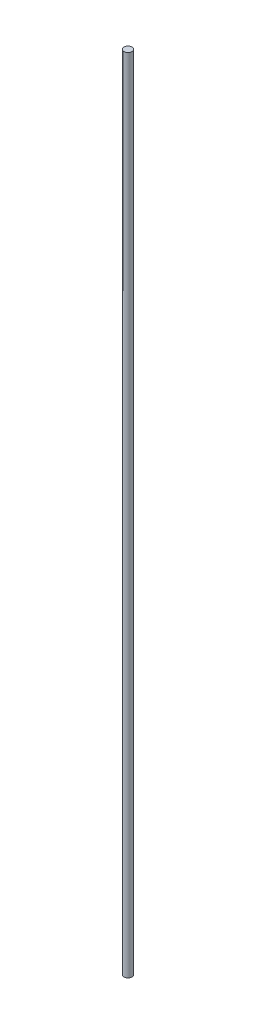
ISO-10303-21;
HEADER;
FILE_DESCRIPTION(('STEP AP214'),'2;1');
FILE_NAME('part.step','',(''),(''),'','','');
FILE_SCHEMA(('AUTOMOTIVE_DESIGN { 1 0 10303 214 1 1 1 1 }'));
ENDSEC;
DATA;
#1=APPLICATION_CONTEXT('core data for automotive mechanical design processes');
#2=APPLICATION_PROTOCOL_DEFINITION('international standard','automotive_design',2000,#1);
#3=PRODUCT_CONTEXT('',#1,'mechanical');
#4=PRODUCT('Part','Part','',(#3));
#5=PRODUCT_RELATED_PRODUCT_CATEGORY('part','',(#4));
#6=PRODUCT_DEFINITION_FORMATION('','',#4);
#7=PRODUCT_DEFINITION_CONTEXT('part definition',#1,'design');
#8=PRODUCT_DEFINITION('design','',#6,#7);
#9=PRODUCT_DEFINITION_SHAPE('','',#8);
#10=(LENGTH_UNIT() NAMED_UNIT(*) SI_UNIT(.MILLI.,.METRE.));
#11=(NAMED_UNIT(*) PLANE_ANGLE_UNIT() SI_UNIT($,.RADIAN.));
#12=(NAMED_UNIT(*) SI_UNIT($,.STERADIAN.) SOLID_ANGLE_UNIT());
#13=UNCERTAINTY_MEASURE_WITH_UNIT(LENGTH_MEASURE(1.E-05),#10,'distance_accuracy_value','');
#14=(GEOMETRIC_REPRESENTATION_CONTEXT(3) GLOBAL_UNCERTAINTY_ASSIGNED_CONTEXT((#13)) GLOBAL_UNIT_ASSIGNED_CONTEXT((#10,
#11,#12)) REPRESENTATION_CONTEXT('',''));
#15=CARTESIAN_POINT('',(0.,0.,0.));
#16=DIRECTION('',(0.,0.,1.));
#17=DIRECTION('',(1.,0.,0.));
#18=AXIS2_PLACEMENT_3D('',#15,#16,#17);
#19=CARTESIAN_POINT('',(0.,4000.,0.));
#20=DIRECTION('',(0.,-1.,0.));
#21=DIRECTION('',(0.,0.,-1.));
#22=AXIS2_PLACEMENT_3D('',#19,#20,#21);
#23=CYLINDRICAL_SURFACE('',#22,20.);
#24=CARTESIAN_POINT('',(0.,4000.,0.));
#25=DIRECTION('',(0.,1.,0.));
#26=DIRECTION('',(0.,0.,1.));
#27=AXIS2_PLACEMENT_3D('',#24,#25,#26);
#28=CIRCLE('',#27,20.);
#29=CARTESIAN_POINT('',(0.,4000.,20.));
#30=VERTEX_POINT('',#29);
#31=EDGE_CURVE('E10',#30,#30,#28,.T.);
#32=ORIENTED_EDGE('',*,*,#31,.F.);
#33=EDGE_LOOP('',(#32));
#34=FACE_BOUND('',#33,.T.);
#35=CARTESIAN_POINT('',(0.,0.,0.));
#36=DIRECTION('',(0.,1.,0.));
#37=DIRECTION('',(0.,0.,1.));
#38=AXIS2_PLACEMENT_3D('',#35,#36,#37);
#39=CIRCLE('',#38,20.);
#40=CARTESIAN_POINT('',(0.,0.,20.));
#41=VERTEX_POINT('',#40);
#42=EDGE_CURVE('E40',#41,#41,#39,.T.);
#43=ORIENTED_EDGE('',*,*,#42,.T.);
#44=EDGE_LOOP('',(#43));
#45=FACE_BOUND('',#44,.T.);
#46=ADVANCED_FACE('F37',(#34,#45),#23,.T.);
#47=CARTESIAN_POINT('',(0.,4000.,0.));
#48=DIRECTION('',(0.,1.,0.));
#49=DIRECTION('',(0.,0.,1.));
#50=AXIS2_PLACEMENT_3D('',#47,#48,#49);
#51=PLANE('',#50);
#52=ORIENTED_EDGE('',*,*,#31,.T.);
#53=EDGE_LOOP('',(#52));
#54=FACE_BOUND('',#53,.T.);
#55=ADVANCED_FACE('F54',(#54),#51,.T.);
#56=CARTESIAN_POINT('',(0.,0.,0.));
#57=DIRECTION('',(0.,1.,0.));
#58=DIRECTION('',(0.,0.,1.));
#59=AXIS2_PLACEMENT_3D('',#56,#57,#58);
#60=PLANE('',#59);
#61=ORIENTED_EDGE('',*,*,#42,.F.);
#62=EDGE_LOOP('',(#61));
#63=FACE_BOUND('',#62,.T.);
#64=ADVANCED_FACE('F52',(#63),#60,.F.);
#65=CLOSED_SHELL('',(#46,#55,#64));
#66=MANIFOLD_SOLID_BREP('B2',#65);
#67=ADVANCED_BREP_SHAPE_REPRESENTATION('',(#18,#66),#14);
#68=SHAPE_DEFINITION_REPRESENTATION(#9,#67);
ENDSEC;
END-ISO-10303-21;
